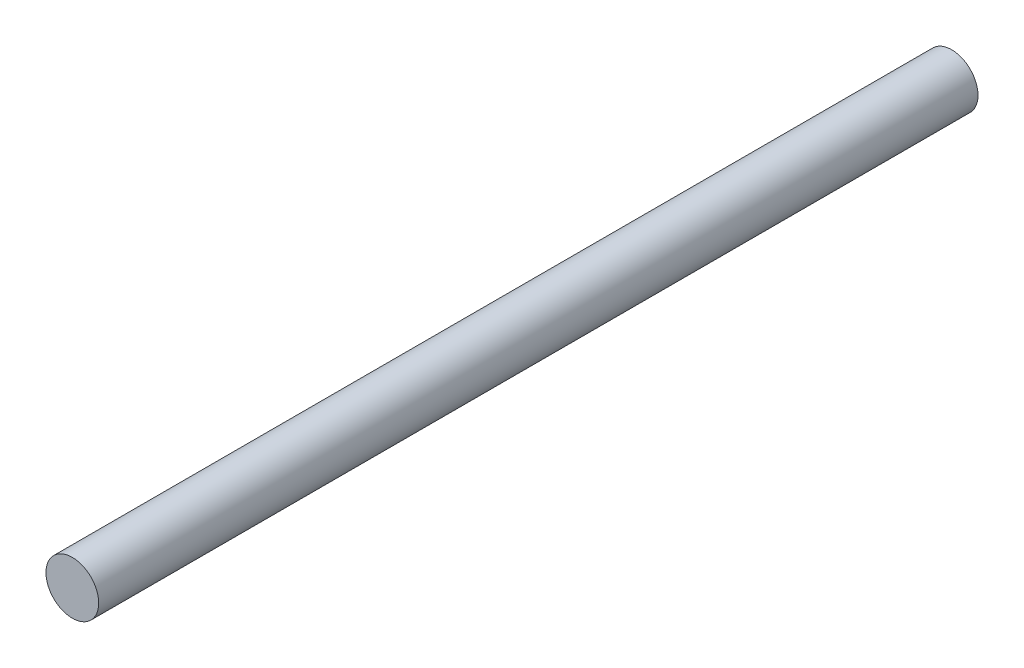
ISO-10303-21;
HEADER;
FILE_DESCRIPTION(('STEP AP214'),'2;1');
FILE_NAME('part.step','',(''),(''),'','','');
FILE_SCHEMA(('AUTOMOTIVE_DESIGN { 1 0 10303 214 1 1 1 1 }'));
ENDSEC;
DATA;
#1=APPLICATION_CONTEXT('core data for automotive mechanical design processes');
#2=APPLICATION_PROTOCOL_DEFINITION('international standard','automotive_design',2000,#1);
#3=PRODUCT_CONTEXT('',#1,'mechanical');
#4=PRODUCT('Part','Part','',(#3));
#5=PRODUCT_RELATED_PRODUCT_CATEGORY('part','',(#4));
#6=PRODUCT_DEFINITION_FORMATION('','',#4);
#7=PRODUCT_DEFINITION_CONTEXT('part definition',#1,'design');
#8=PRODUCT_DEFINITION('design','',#6,#7);
#9=PRODUCT_DEFINITION_SHAPE('','',#8);
#10=(LENGTH_UNIT() NAMED_UNIT(*) SI_UNIT(.MILLI.,.METRE.));
#11=(NAMED_UNIT(*) PLANE_ANGLE_UNIT() SI_UNIT($,.RADIAN.));
#12=(NAMED_UNIT(*) SI_UNIT($,.STERADIAN.) SOLID_ANGLE_UNIT());
#13=UNCERTAINTY_MEASURE_WITH_UNIT(LENGTH_MEASURE(1.E-05),#10,'distance_accuracy_value','');
#14=(GEOMETRIC_REPRESENTATION_CONTEXT(3) GLOBAL_UNCERTAINTY_ASSIGNED_CONTEXT((#13)) GLOBAL_UNIT_ASSIGNED_CONTEXT((#10,
#11,#12)) REPRESENTATION_CONTEXT('',''));
#15=CARTESIAN_POINT('',(0.,0.,0.));
#16=DIRECTION('',(0.,0.,1.));
#17=DIRECTION('',(1.,0.,0.));
#18=AXIS2_PLACEMENT_3D('',#15,#16,#17);
#19=CARTESIAN_POINT('',(0.,0.212314024015007,100.));
#20=DIRECTION('',(0.,0.,-1.));
#21=DIRECTION('',(-1.,0.,0.));
#22=AXIS2_PLACEMENT_3D('',#19,#20,#21);
#23=CYLINDRICAL_SURFACE('',#22,3.);
#24=CARTESIAN_POINT('',(0.,0.212314024015007,100.));
#25=DIRECTION('',(0.,0.,1.));
#26=DIRECTION('',(1.,0.,0.));
#27=AXIS2_PLACEMENT_3D('',#24,#25,#26);
#28=CIRCLE('',#27,3.);
#29=CARTESIAN_POINT('',(3.,0.212314024015007,100.));
#30=VERTEX_POINT('',#29);
#31=EDGE_CURVE('E10',#30,#30,#28,.T.);
#32=ORIENTED_EDGE('',*,*,#31,.F.);
#33=EDGE_LOOP('',(#32));
#34=FACE_BOUND('',#33,.T.);
#35=CARTESIAN_POINT('',(0.,0.212314024015007,0.));
#36=DIRECTION('',(0.,0.,1.));
#37=DIRECTION('',(1.,0.,0.));
#38=AXIS2_PLACEMENT_3D('',#35,#36,#37);
#39=CIRCLE('',#38,3.);
#40=CARTESIAN_POINT('',(3.,0.212314024015007,0.));
#41=VERTEX_POINT('',#40);
#42=EDGE_CURVE('E44',#41,#41,#39,.T.);
#43=ORIENTED_EDGE('',*,*,#42,.T.);
#44=EDGE_LOOP('',(#43));
#45=FACE_BOUND('',#44,.T.);
#46=ADVANCED_FACE('F41',(#34,#45),#23,.T.);
#47=CARTESIAN_POINT('',(0.,0.212314024015007,100.));
#48=DIRECTION('',(0.,0.,1.));
#49=DIRECTION('',(1.,0.,0.));
#50=AXIS2_PLACEMENT_3D('',#47,#48,#49);
#51=PLANE('',#50);
#52=ORIENTED_EDGE('',*,*,#31,.T.);
#53=EDGE_LOOP('',(#52));
#54=FACE_BOUND('',#53,.T.);
#55=ADVANCED_FACE('F58',(#54),#51,.T.);
#56=CARTESIAN_POINT('',(0.,0.212314024015007,0.));
#57=DIRECTION('',(0.,0.,1.));
#58=DIRECTION('',(1.,0.,0.));
#59=AXIS2_PLACEMENT_3D('',#56,#57,#58);
#60=PLANE('',#59);
#61=ORIENTED_EDGE('',*,*,#42,.F.);
#62=EDGE_LOOP('',(#61));
#63=FACE_BOUND('',#62,.T.);
#64=ADVANCED_FACE('F56',(#63),#60,.F.);
#65=CLOSED_SHELL('',(#46,#55,#64));
#66=MANIFOLD_SOLID_BREP('B2',#65);
#67=ADVANCED_BREP_SHAPE_REPRESENTATION('',(#18,#66),#14);
#68=SHAPE_DEFINITION_REPRESENTATION(#9,#67);
ENDSEC;
END-ISO-10303-21;
